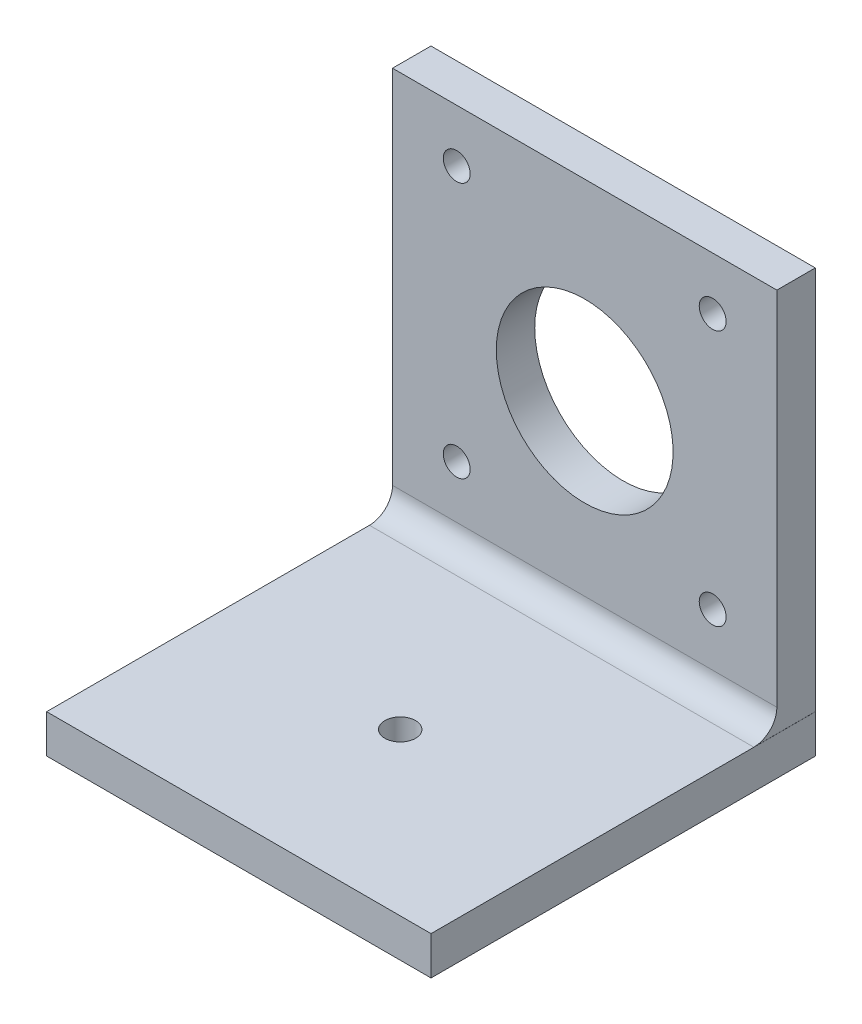
ISO-10303-21;
HEADER;
FILE_DESCRIPTION(('STEP AP214'),'2;1');
FILE_NAME('part.step','',(''),(''),'','','');
FILE_SCHEMA(('AUTOMOTIVE_DESIGN { 1 0 10303 214 1 1 1 1 }'));
ENDSEC;
DATA;
#1=APPLICATION_CONTEXT('core data for automotive mechanical design processes');
#2=APPLICATION_PROTOCOL_DEFINITION('international standard','automotive_design',2000,#1);
#3=PRODUCT_CONTEXT('',#1,'mechanical');
#4=PRODUCT('Part','Part','',(#3));
#5=PRODUCT_RELATED_PRODUCT_CATEGORY('part','',(#4));
#6=PRODUCT_DEFINITION_FORMATION('','',#4);
#7=PRODUCT_DEFINITION_CONTEXT('part definition',#1,'design');
#8=PRODUCT_DEFINITION('design','',#6,#7);
#9=PRODUCT_DEFINITION_SHAPE('','',#8);
#10=(LENGTH_UNIT() NAMED_UNIT(*) SI_UNIT(.MILLI.,.METRE.));
#11=(NAMED_UNIT(*) PLANE_ANGLE_UNIT() SI_UNIT($,.RADIAN.));
#12=(NAMED_UNIT(*) SI_UNIT($,.STERADIAN.) SOLID_ANGLE_UNIT());
#13=UNCERTAINTY_MEASURE_WITH_UNIT(LENGTH_MEASURE(1.E-05),#10,'distance_accuracy_value','');
#14=(GEOMETRIC_REPRESENTATION_CONTEXT(3) GLOBAL_UNCERTAINTY_ASSIGNED_CONTEXT((#13)) GLOBAL_UNIT_ASSIGNED_CONTEXT((#10,
#11,#12)) REPRESENTATION_CONTEXT('',''));
#15=CARTESIAN_POINT('',(0.,0.,0.));
#16=DIRECTION('',(0.,0.,1.));
#17=DIRECTION('',(1.,0.,0.));
#18=AXIS2_PLACEMENT_3D('',#15,#16,#17);
#19=CARTESIAN_POINT('',(0.,0.,5.));
#20=DIRECTION('',(0.,0.,-1.));
#21=DIRECTION('',(-1.,0.,0.));
#22=AXIS2_PLACEMENT_3D('',#19,#20,#21);
#23=PLANE('',#22);
#24=CARTESIAN_POINT('',(41.65,43.15,5.));
#25=DIRECTION('',(0.,0.,-1.));
#26=DIRECTION('',(-1.,0.,0.));
#27=AXIS2_PLACEMENT_3D('',#24,#25,#26);
#28=CIRCLE('',#27,1.75);
#29=CARTESIAN_POINT('',(39.9,43.15,5.));
#30=VERTEX_POINT('',#29);
#31=EDGE_CURVE('E162',#30,#30,#28,.F.);
#32=ORIENTED_EDGE('',*,*,#31,.F.);
#33=EDGE_LOOP('',(#32));
#34=FACE_BOUND('',#33,.T.);
#35=CARTESIAN_POINT('',(8.34999999999997,9.85,5.));
#36=DIRECTION('',(0.,0.,-1.));
#37=DIRECTION('',(-1.,0.,0.));
#38=AXIS2_PLACEMENT_3D('',#35,#36,#37);
#39=CIRCLE('',#38,1.75);
#40=CARTESIAN_POINT('',(6.59999999999998,9.85,5.));
#41=VERTEX_POINT('',#40);
#42=EDGE_CURVE('E147',#41,#41,#39,.F.);
#43=ORIENTED_EDGE('',*,*,#42,.F.);
#44=EDGE_LOOP('',(#43));
#45=FACE_BOUND('',#44,.T.);
#46=CARTESIAN_POINT('',(25.,25.,5.));
#47=DIRECTION('',(0.,0.,-1.));
#48=DIRECTION('',(-1.,0.,0.));
#49=AXIS2_PLACEMENT_3D('',#46,#47,#48);
#50=CIRCLE('',#49,11.5);
#51=CARTESIAN_POINT('',(13.5,25.,5.));
#52=VERTEX_POINT('',#51);
#53=EDGE_CURVE('E124',#52,#52,#50,.T.);
#54=ORIENTED_EDGE('',*,*,#53,.T.);
#55=EDGE_LOOP('',(#54));
#56=FACE_BOUND('',#55,.T.);
#57=DIRECTION('',(0.,-1.,0.));
#58=VECTOR('',#57,1.);
#59=CARTESIAN_POINT('',(0.,0.,5.));
#60=LINE('',#59,#58);
#61=CARTESIAN_POINT('',(0.,50.,5.));
#62=VERTEX_POINT('',#61);
#63=CARTESIAN_POINT('',(0.,3.,5.));
#64=VERTEX_POINT('',#63);
#65=EDGE_CURVE('E357',#62,#64,#60,.T.);
#66=ORIENTED_EDGE('',*,*,#65,.T.);
#67=DIRECTION('',(1.,0.,0.));
#68=VECTOR('',#67,1.);
#69=CARTESIAN_POINT('',(50.,3.,5.));
#70=LINE('',#69,#68);
#71=CARTESIAN_POINT('',(50.,3.,5.));
#72=VERTEX_POINT('',#71);
#73=EDGE_CURVE('E367',#64,#72,#70,.T.);
#74=ORIENTED_EDGE('',*,*,#73,.T.);
#75=DIRECTION('',(0.,1.,0.));
#76=VECTOR('',#75,1.);
#77=CARTESIAN_POINT('',(50.,0.,5.));
#78=LINE('',#77,#76);
#79=CARTESIAN_POINT('',(50.,50.,5.));
#80=VERTEX_POINT('',#79);
#81=EDGE_CURVE('E376',#72,#80,#78,.T.);
#82=ORIENTED_EDGE('',*,*,#81,.T.);
#83=DIRECTION('',(-1.,0.,0.));
#84=VECTOR('',#83,1.);
#85=CARTESIAN_POINT('',(0.,50.,5.));
#86=LINE('',#85,#84);
#87=EDGE_CURVE('E354',#80,#62,#86,.T.);
#88=ORIENTED_EDGE('',*,*,#87,.T.);
#89=EDGE_LOOP('',(#66,#74,#82,#88));
#90=FACE_BOUND('',#89,.T.);
#91=CARTESIAN_POINT('',(8.34999999999999,43.15,5.));
#92=DIRECTION('',(0.,0.,-1.));
#93=DIRECTION('',(-1.,0.,0.));
#94=AXIS2_PLACEMENT_3D('',#91,#92,#93);
#95=CIRCLE('',#94,1.75);
#96=CARTESIAN_POINT('',(6.59999999999999,43.15,5.));
#97=VERTEX_POINT('',#96);
#98=EDGE_CURVE('E154',#97,#97,#95,.F.);
#99=ORIENTED_EDGE('',*,*,#98,.F.);
#100=EDGE_LOOP('',(#99));
#101=FACE_BOUND('',#100,.T.);
#102=CARTESIAN_POINT('',(41.65,9.85,5.));
#103=DIRECTION('',(0.,0.,-1.));
#104=DIRECTION('',(-1.,0.,0.));
#105=AXIS2_PLACEMENT_3D('',#102,#103,#104);
#106=CIRCLE('',#105,1.75);
#107=CARTESIAN_POINT('',(39.9,9.85,5.));
#108=VERTEX_POINT('',#107);
#109=EDGE_CURVE('E168',#108,#108,#106,.F.);
#110=ORIENTED_EDGE('',*,*,#109,.F.);
#111=EDGE_LOOP('',(#110));
#112=FACE_BOUND('',#111,.T.);
#113=ADVANCED_FACE('F33',(#34,#45,#56,#90,#101,#112),#23,.F.);
#114=CARTESIAN_POINT('',(0.,0.,0.));
#115=DIRECTION('',(0.,0.,-1.));
#116=DIRECTION('',(-1.,0.,0.));
#117=AXIS2_PLACEMENT_3D('',#114,#115,#116);
#118=PLANE('',#117);
#119=CARTESIAN_POINT('',(41.65,43.15,0.));
#120=DIRECTION('',(0.,0.,1.));
#121=DIRECTION('',(1.,0.,0.));
#122=AXIS2_PLACEMENT_3D('',#119,#120,#121);
#123=CIRCLE('',#122,1.75);
#124=CARTESIAN_POINT('',(43.4,43.15,0.));
#125=VERTEX_POINT('',#124);
#126=EDGE_CURVE('E165',#125,#125,#123,.T.);
#127=ORIENTED_EDGE('',*,*,#126,.T.);
#128=EDGE_LOOP('',(#127));
#129=FACE_BOUND('',#128,.T.);
#130=CARTESIAN_POINT('',(8.34999999999997,9.85,0.));
#131=DIRECTION('',(0.,0.,1.));
#132=DIRECTION('',(1.,0.,0.));
#133=AXIS2_PLACEMENT_3D('',#130,#131,#132);
#134=CIRCLE('',#133,1.75);
#135=CARTESIAN_POINT('',(10.1,9.85,0.));
#136=VERTEX_POINT('',#135);
#137=EDGE_CURVE('E149',#136,#136,#134,.T.);
#138=ORIENTED_EDGE('',*,*,#137,.T.);
#139=EDGE_LOOP('',(#138));
#140=FACE_BOUND('',#139,.T.);
#141=CARTESIAN_POINT('',(25.,25.,0.));
#142=DIRECTION('',(0.,0.,-1.));
#143=DIRECTION('',(-1.,0.,0.));
#144=AXIS2_PLACEMENT_3D('',#141,#142,#143);
#145=CIRCLE('',#144,11.5);
#146=CARTESIAN_POINT('',(13.5,25.,0.));
#147=VERTEX_POINT('',#146);
#148=EDGE_CURVE('E121',#147,#147,#145,.T.);
#149=ORIENTED_EDGE('',*,*,#148,.F.);
#150=EDGE_LOOP('',(#149));
#151=FACE_BOUND('',#150,.T.);
#152=DIRECTION('',(0.,-1.,0.));
#153=VECTOR('',#152,1.);
#154=CARTESIAN_POINT('',(0.,0.,0.));
#155=LINE('',#154,#153);
#156=CARTESIAN_POINT('',(0.,50.,0.));
#157=VERTEX_POINT('',#156);
#158=CARTESIAN_POINT('',(0.,-5.,0.));
#159=VERTEX_POINT('',#158);
#160=EDGE_CURVE('E119',#157,#159,#155,.T.);
#161=ORIENTED_EDGE('',*,*,#160,.F.);
#162=DIRECTION('',(-1.,0.,0.));
#163=VECTOR('',#162,1.);
#164=CARTESIAN_POINT('',(0.,50.,0.));
#165=LINE('',#164,#163);
#166=CARTESIAN_POINT('',(50.,50.,0.));
#167=VERTEX_POINT('',#166);
#168=EDGE_CURVE('E346',#167,#157,#165,.T.);
#169=ORIENTED_EDGE('',*,*,#168,.F.);
#170=DIRECTION('',(0.,1.,0.));
#171=VECTOR('',#170,1.);
#172=CARTESIAN_POINT('',(50.,0.,0.));
#173=LINE('',#172,#171);
#174=CARTESIAN_POINT('',(50.,0.,0.));
#175=VERTEX_POINT('',#174);
#176=EDGE_CURVE('E348',#175,#167,#173,.T.);
#177=ORIENTED_EDGE('',*,*,#176,.F.);
#178=DIRECTION('',(-1.,0.,0.));
#179=VECTOR('',#178,1.);
#180=CARTESIAN_POINT('',(0.,0.,0.));
#181=LINE('',#180,#179);
#182=CARTESIAN_POINT('',(50.0110248377446,0.,0.));
#183=VERTEX_POINT('',#182);
#184=EDGE_CURVE('E114',#183,#175,#181,.T.);
#185=ORIENTED_EDGE('',*,*,#184,.F.);
#186=DIRECTION('',(0.,1.,0.));
#187=VECTOR('',#186,1.);
#188=CARTESIAN_POINT('',(50.0110248377446,0.,0.));
#189=LINE('',#188,#187);
#190=CARTESIAN_POINT('',(50.0110248377446,-5.,0.));
#191=VERTEX_POINT('',#190);
#192=EDGE_CURVE('E132',#191,#183,#189,.T.);
#193=ORIENTED_EDGE('',*,*,#192,.F.);
#194=DIRECTION('',(1.,0.,0.));
#195=VECTOR('',#194,1.);
#196=CARTESIAN_POINT('',(0.,-5.,0.));
#197=LINE('',#196,#195);
#198=EDGE_CURVE('E146',#159,#191,#197,.T.);
#199=ORIENTED_EDGE('',*,*,#198,.F.);
#200=EDGE_LOOP('',(#161,#169,#177,#185,#193,#199));
#201=FACE_BOUND('',#200,.T.);
#202=CARTESIAN_POINT('',(8.34999999999999,43.15,0.));
#203=DIRECTION('',(0.,0.,1.));
#204=DIRECTION('',(1.,0.,0.));
#205=AXIS2_PLACEMENT_3D('',#202,#203,#204);
#206=CIRCLE('',#205,1.75);
#207=CARTESIAN_POINT('',(10.1,43.15,0.));
#208=VERTEX_POINT('',#207);
#209=EDGE_CURVE('E159',#208,#208,#206,.T.);
#210=ORIENTED_EDGE('',*,*,#209,.T.);
#211=EDGE_LOOP('',(#210));
#212=FACE_BOUND('',#211,.T.);
#213=CARTESIAN_POINT('',(41.65,9.85,0.));
#214=DIRECTION('',(0.,0.,1.));
#215=DIRECTION('',(1.,0.,0.));
#216=AXIS2_PLACEMENT_3D('',#213,#214,#215);
#217=CIRCLE('',#216,1.75);
#218=CARTESIAN_POINT('',(43.4,9.85,0.));
#219=VERTEX_POINT('',#218);
#220=EDGE_CURVE('E171',#219,#219,#217,.T.);
#221=ORIENTED_EDGE('',*,*,#220,.T.);
#222=EDGE_LOOP('',(#221));
#223=FACE_BOUND('',#222,.T.);
#224=ADVANCED_FACE('F196',(#129,#140,#151,#201,#212,#223),#118,.T.);
#225=CARTESIAN_POINT('',(0.,0.,5.));
#226=DIRECTION('',(1.,0.,0.));
#227=DIRECTION('',(0.,1.,0.));
#228=AXIS2_PLACEMENT_3D('',#225,#226,#227);
#229=PLANE('',#228);
#230=ORIENTED_EDGE('',*,*,#160,.T.);
#231=DIRECTION('',(0.,0.,-1.));
#232=VECTOR('',#231,1.);
#233=CARTESIAN_POINT('',(0.,-5.,50.));
#234=LINE('',#233,#232);
#235=CARTESIAN_POINT('',(0.,-5.,50.));
#236=VERTEX_POINT('',#235);
#237=EDGE_CURVE('E101',#236,#159,#234,.T.);
#238=ORIENTED_EDGE('',*,*,#237,.F.);
#239=DIRECTION('',(0.,-1.,0.));
#240=VECTOR('',#239,1.);
#241=CARTESIAN_POINT('',(0.,0.,50.));
#242=LINE('',#241,#240);
#243=CARTESIAN_POINT('',(0.,0.,50.));
#244=VERTEX_POINT('',#243);
#245=EDGE_CURVE('E107',#244,#236,#242,.T.);
#246=ORIENTED_EDGE('',*,*,#245,.F.);
#247=DIRECTION('',(0.,0.,-1.));
#248=VECTOR('',#247,1.);
#249=CARTESIAN_POINT('',(0.,0.,50.));
#250=LINE('',#249,#248);
#251=CARTESIAN_POINT('',(0.,0.,8.));
#252=VERTEX_POINT('',#251);
#253=EDGE_CURVE('E133',#244,#252,#250,.T.);
#254=ORIENTED_EDGE('',*,*,#253,.T.);
#255=CARTESIAN_POINT('',(0.,3.,8.));
#256=DIRECTION('',(1.,0.,0.));
#257=DIRECTION('',(0.,1.,0.));
#258=AXIS2_PLACEMENT_3D('',#255,#256,#257);
#259=CIRCLE('',#258,3.);
#260=EDGE_CURVE('E11',#252,#64,#259,.T.);
#261=ORIENTED_EDGE('',*,*,#260,.T.);
#262=ORIENTED_EDGE('',*,*,#65,.F.);
#263=DIRECTION('',(0.,0.,-1.));
#264=VECTOR('',#263,1.);
#265=CARTESIAN_POINT('',(0.,50.,5.));
#266=LINE('',#265,#264);
#267=EDGE_CURVE('E358',#62,#157,#266,.T.);
#268=ORIENTED_EDGE('',*,*,#267,.T.);
#269=EDGE_LOOP('',(#230,#238,#246,#254,#261,#262,#268));
#270=FACE_BOUND('',#269,.T.);
#271=ADVANCED_FACE('F116',(#270),#229,.F.);
#272=CARTESIAN_POINT('',(50.,0.,5.));
#273=DIRECTION('',(-1.,0.,0.));
#274=DIRECTION('',(0.,-1.,0.));
#275=AXIS2_PLACEMENT_3D('',#272,#273,#274);
#276=PLANE('',#275);
#277=ORIENTED_EDGE('',*,*,#176,.T.);
#278=DIRECTION('',(0.,0.,-1.));
#279=VECTOR('',#278,1.);
#280=CARTESIAN_POINT('',(50.,50.,5.));
#281=LINE('',#280,#279);
#282=EDGE_CURVE('E360',#80,#167,#281,.T.);
#283=ORIENTED_EDGE('',*,*,#282,.F.);
#284=ORIENTED_EDGE('',*,*,#81,.F.);
#285=CARTESIAN_POINT('',(50.,3.,8.));
#286=DIRECTION('',(-1.,0.,0.));
#287=DIRECTION('',(0.,-1.,0.));
#288=AXIS2_PLACEMENT_3D('',#285,#286,#287);
#289=CIRCLE('',#288,3.);
#290=CARTESIAN_POINT('',(50.,0.,8.));
#291=VERTEX_POINT('',#290);
#292=EDGE_CURVE('E41',#72,#291,#289,.T.);
#293=ORIENTED_EDGE('',*,*,#292,.T.);
#294=DIRECTION('',(0.,0.,-1.));
#295=VECTOR('',#294,1.);
#296=CARTESIAN_POINT('',(50.,0.,5.));
#297=LINE('',#296,#295);
#298=EDGE_CURVE('E48',#291,#175,#297,.T.);
#299=ORIENTED_EDGE('',*,*,#298,.T.);
#300=EDGE_LOOP('',(#277,#283,#284,#293,#299));
#301=FACE_BOUND('',#300,.T.);
#302=ADVANCED_FACE('F213',(#301),#276,.F.);
#303=CARTESIAN_POINT('',(0.,50.,5.));
#304=DIRECTION('',(0.,-1.,0.));
#305=DIRECTION('',(0.,0.,-1.));
#306=AXIS2_PLACEMENT_3D('',#303,#304,#305);
#307=PLANE('',#306);
#308=ORIENTED_EDGE('',*,*,#168,.T.);
#309=ORIENTED_EDGE('',*,*,#267,.F.);
#310=ORIENTED_EDGE('',*,*,#87,.F.);
#311=ORIENTED_EDGE('',*,*,#282,.T.);
#312=EDGE_LOOP('',(#308,#309,#310,#311));
#313=FACE_BOUND('',#312,.T.);
#314=ADVANCED_FACE('F210',(#313),#307,.F.);
#315=CARTESIAN_POINT('',(25.,25.,-14.));
#316=DIRECTION('',(0.,0.,1.));
#317=DIRECTION('',(1.,0.,0.));
#318=AXIS2_PLACEMENT_3D('',#315,#316,#317);
#319=CYLINDRICAL_SURFACE('',#318,11.5);
#320=ORIENTED_EDGE('',*,*,#148,.T.);
#321=EDGE_LOOP('',(#320));
#322=FACE_BOUND('',#321,.T.);
#323=ORIENTED_EDGE('',*,*,#53,.F.);
#324=EDGE_LOOP('',(#323));
#325=FACE_BOUND('',#324,.T.);
#326=ADVANCED_FACE('F207',(#322,#325),#319,.F.);
#327=CARTESIAN_POINT('',(0.,-5.,50.));
#328=DIRECTION('',(0.,1.,0.));
#329=DIRECTION('',(0.,0.,1.));
#330=AXIS2_PLACEMENT_3D('',#327,#328,#329);
#331=PLANE('',#330);
#332=CARTESIAN_POINT('',(25.0027562094362,-5.,29.));
#333=DIRECTION('',(0.,1.,0.));
#334=DIRECTION('',(0.,0.,1.));
#335=AXIS2_PLACEMENT_3D('',#332,#333,#334);
#336=CIRCLE('',#335,2.);
#337=CARTESIAN_POINT('',(25.0027562094362,-5.,31.));
#338=VERTEX_POINT('',#337);
#339=EDGE_CURVE('E174',#338,#338,#336,.T.);
#340=ORIENTED_EDGE('',*,*,#339,.T.);
#341=EDGE_LOOP('',(#340));
#342=FACE_BOUND('',#341,.T.);
#343=ORIENTED_EDGE('',*,*,#198,.T.);
#344=DIRECTION('',(0.,0.,-1.));
#345=VECTOR('',#344,1.);
#346=CARTESIAN_POINT('',(50.0110248377446,-5.,50.));
#347=LINE('',#346,#345);
#348=CARTESIAN_POINT('',(50.0110248377446,-5.,50.));
#349=VERTEX_POINT('',#348);
#350=EDGE_CURVE('E103',#349,#191,#347,.T.);
#351=ORIENTED_EDGE('',*,*,#350,.F.);
#352=DIRECTION('',(1.,0.,0.));
#353=VECTOR('',#352,1.);
#354=CARTESIAN_POINT('',(0.,-5.,50.));
#355=LINE('',#354,#353);
#356=EDGE_CURVE('E97',#236,#349,#355,.T.);
#357=ORIENTED_EDGE('',*,*,#356,.F.);
#358=ORIENTED_EDGE('',*,*,#237,.T.);
#359=EDGE_LOOP('',(#343,#351,#357,#358));
#360=FACE_BOUND('',#359,.T.);
#361=ADVANCED_FACE('F99',(#342,#360),#331,.F.);
#362=CARTESIAN_POINT('',(50.0110248377446,0.,50.));
#363=DIRECTION('',(-1.,0.,0.));
#364=DIRECTION('',(0.,0.,1.));
#365=AXIS2_PLACEMENT_3D('',#362,#363,#364);
#366=PLANE('',#365);
#367=ORIENTED_EDGE('',*,*,#192,.T.);
#368=DIRECTION('',(0.,0.,-1.));
#369=VECTOR('',#368,1.);
#370=CARTESIAN_POINT('',(50.0110248377446,0.,50.));
#371=LINE('',#370,#369);
#372=CARTESIAN_POINT('',(50.0110248377446,0.,50.));
#373=VERTEX_POINT('',#372);
#374=EDGE_CURVE('E126',#373,#183,#371,.T.);
#375=ORIENTED_EDGE('',*,*,#374,.F.);
#376=DIRECTION('',(0.,1.,0.));
#377=VECTOR('',#376,1.);
#378=CARTESIAN_POINT('',(50.0110248377446,0.,50.));
#379=LINE('',#378,#377);
#380=EDGE_CURVE('E106',#349,#373,#379,.T.);
#381=ORIENTED_EDGE('',*,*,#380,.F.);
#382=ORIENTED_EDGE('',*,*,#350,.T.);
#383=EDGE_LOOP('',(#367,#375,#381,#382));
#384=FACE_BOUND('',#383,.T.);
#385=ADVANCED_FACE('F186',(#384),#366,.F.);
#386=CARTESIAN_POINT('',(0.,0.,50.));
#387=DIRECTION('',(0.,-1.,0.));
#388=DIRECTION('',(0.,0.,-1.));
#389=AXIS2_PLACEMENT_3D('',#386,#387,#388);
#390=PLANE('',#389);
#391=CARTESIAN_POINT('',(25.0027562094362,0.,29.));
#392=DIRECTION('',(0.,1.,0.));
#393=DIRECTION('',(0.,0.,1.));
#394=AXIS2_PLACEMENT_3D('',#391,#392,#393);
#395=CIRCLE('',#394,2.);
#396=CARTESIAN_POINT('',(25.0027562094362,0.,31.));
#397=VERTEX_POINT('',#396);
#398=EDGE_CURVE('E177',#397,#397,#395,.T.);
#399=ORIENTED_EDGE('',*,*,#398,.F.);
#400=EDGE_LOOP('',(#399));
#401=FACE_BOUND('',#400,.T.);
#402=ORIENTED_EDGE('',*,*,#298,.F.);
#403=DIRECTION('',(1.,0.,0.));
#404=VECTOR('',#403,1.);
#405=CARTESIAN_POINT('',(0.,0.,8.));
#406=LINE('',#405,#404);
#407=EDGE_CURVE('E53',#291,#252,#406,.F.);
#408=ORIENTED_EDGE('',*,*,#407,.T.);
#409=ORIENTED_EDGE('',*,*,#253,.F.);
#410=DIRECTION('',(-1.,0.,0.));
#411=VECTOR('',#410,1.);
#412=CARTESIAN_POINT('',(0.,0.,50.));
#413=LINE('',#412,#411);
#414=EDGE_CURVE('E112',#373,#244,#413,.T.);
#415=ORIENTED_EDGE('',*,*,#414,.F.);
#416=ORIENTED_EDGE('',*,*,#374,.T.);
#417=ORIENTED_EDGE('',*,*,#184,.T.);
#418=EDGE_LOOP('',(#402,#408,#409,#415,#416,#417));
#419=FACE_BOUND('',#418,.T.);
#420=ADVANCED_FACE('F184',(#401,#419),#390,.F.);
#421=CARTESIAN_POINT('',(0.,0.,50.));
#422=DIRECTION('',(0.,0.,1.));
#423=DIRECTION('',(1.,0.,0.));
#424=AXIS2_PLACEMENT_3D('',#421,#422,#423);
#425=PLANE('',#424);
#426=ORIENTED_EDGE('',*,*,#245,.T.);
#427=ORIENTED_EDGE('',*,*,#356,.T.);
#428=ORIENTED_EDGE('',*,*,#380,.T.);
#429=ORIENTED_EDGE('',*,*,#414,.T.);
#430=EDGE_LOOP('',(#426,#427,#428,#429));
#431=FACE_BOUND('',#430,.T.);
#432=ADVANCED_FACE('F110',(#431),#425,.T.);
#433=CARTESIAN_POINT('',(0.,3.,8.));
#434=DIRECTION('',(-1.,0.,0.));
#435=DIRECTION('',(0.,0.,1.));
#436=AXIS2_PLACEMENT_3D('',#433,#434,#435);
#437=CYLINDRICAL_SURFACE('',#436,3.);
#438=ORIENTED_EDGE('',*,*,#260,.F.);
#439=ORIENTED_EDGE('',*,*,#407,.F.);
#440=ORIENTED_EDGE('',*,*,#292,.F.);
#441=ORIENTED_EDGE('',*,*,#73,.F.);
#442=EDGE_LOOP('',(#438,#439,#440,#441));
#443=FACE_BOUND('',#442,.T.);
#444=ADVANCED_FACE('F35',(#443),#437,.F.);
#445=CARTESIAN_POINT('',(8.34999999999997,9.85,11.));
#446=DIRECTION('',(0.,0.,-1.));
#447=DIRECTION('',(-1.,0.,0.));
#448=AXIS2_PLACEMENT_3D('',#445,#446,#447);
#449=CYLINDRICAL_SURFACE('',#448,1.75);
#450=ORIENTED_EDGE('',*,*,#137,.F.);
#451=EDGE_LOOP('',(#450));
#452=FACE_BOUND('',#451,.T.);
#453=ORIENTED_EDGE('',*,*,#42,.T.);
#454=EDGE_LOOP('',(#453));
#455=FACE_BOUND('',#454,.T.);
#456=ADVANCED_FACE('F263',(#452,#455),#449,.F.);
#457=CARTESIAN_POINT('',(8.34999999999999,43.15,11.));
#458=DIRECTION('',(0.,0.,-1.));
#459=DIRECTION('',(-1.,0.,0.));
#460=AXIS2_PLACEMENT_3D('',#457,#458,#459);
#461=CYLINDRICAL_SURFACE('',#460,1.75);
#462=ORIENTED_EDGE('',*,*,#209,.F.);
#463=EDGE_LOOP('',(#462));
#464=FACE_BOUND('',#463,.T.);
#465=ORIENTED_EDGE('',*,*,#98,.T.);
#466=EDGE_LOOP('',(#465));
#467=FACE_BOUND('',#466,.T.);
#468=ADVANCED_FACE('F269',(#464,#467),#461,.F.);
#469=CARTESIAN_POINT('',(41.65,43.15,11.));
#470=DIRECTION('',(0.,0.,-1.));
#471=DIRECTION('',(-1.,0.,0.));
#472=AXIS2_PLACEMENT_3D('',#469,#470,#471);
#473=CYLINDRICAL_SURFACE('',#472,1.75);
#474=ORIENTED_EDGE('',*,*,#126,.F.);
#475=EDGE_LOOP('',(#474));
#476=FACE_BOUND('',#475,.T.);
#477=ORIENTED_EDGE('',*,*,#31,.T.);
#478=EDGE_LOOP('',(#477));
#479=FACE_BOUND('',#478,.T.);
#480=ADVANCED_FACE('F277',(#476,#479),#473,.F.);
#481=CARTESIAN_POINT('',(41.65,9.85,11.));
#482=DIRECTION('',(0.,0.,-1.));
#483=DIRECTION('',(-1.,0.,0.));
#484=AXIS2_PLACEMENT_3D('',#481,#482,#483);
#485=CYLINDRICAL_SURFACE('',#484,1.75);
#486=ORIENTED_EDGE('',*,*,#220,.F.);
#487=EDGE_LOOP('',(#486));
#488=FACE_BOUND('',#487,.T.);
#489=ORIENTED_EDGE('',*,*,#109,.T.);
#490=EDGE_LOOP('',(#489));
#491=FACE_BOUND('',#490,.T.);
#492=ADVANCED_FACE('F285',(#488,#491),#485,.F.);
#493=CARTESIAN_POINT('',(25.0027562094362,-14.,29.));
#494=DIRECTION('',(0.,1.,0.));
#495=DIRECTION('',(0.,0.,1.));
#496=AXIS2_PLACEMENT_3D('',#493,#494,#495);
#497=CYLINDRICAL_SURFACE('',#496,2.);
#498=ORIENTED_EDGE('',*,*,#398,.T.);
#499=EDGE_LOOP('',(#498));
#500=FACE_BOUND('',#499,.T.);
#501=ORIENTED_EDGE('',*,*,#339,.F.);
#502=EDGE_LOOP('',(#501));
#503=FACE_BOUND('',#502,.T.);
#504=ADVANCED_FACE('F181',(#500,#503),#497,.F.);
#505=CLOSED_SHELL('',(#113,#224,#271,#302,#314,#326,#361,#385,#420,#432,#444,#456,#468,#480,
#492,#504));
#506=MANIFOLD_SOLID_BREP('B2',#505);
#507=ADVANCED_BREP_SHAPE_REPRESENTATION('',(#18,#506),#14);
#508=SHAPE_DEFINITION_REPRESENTATION(#9,#507);
ENDSEC;
END-ISO-10303-21;
